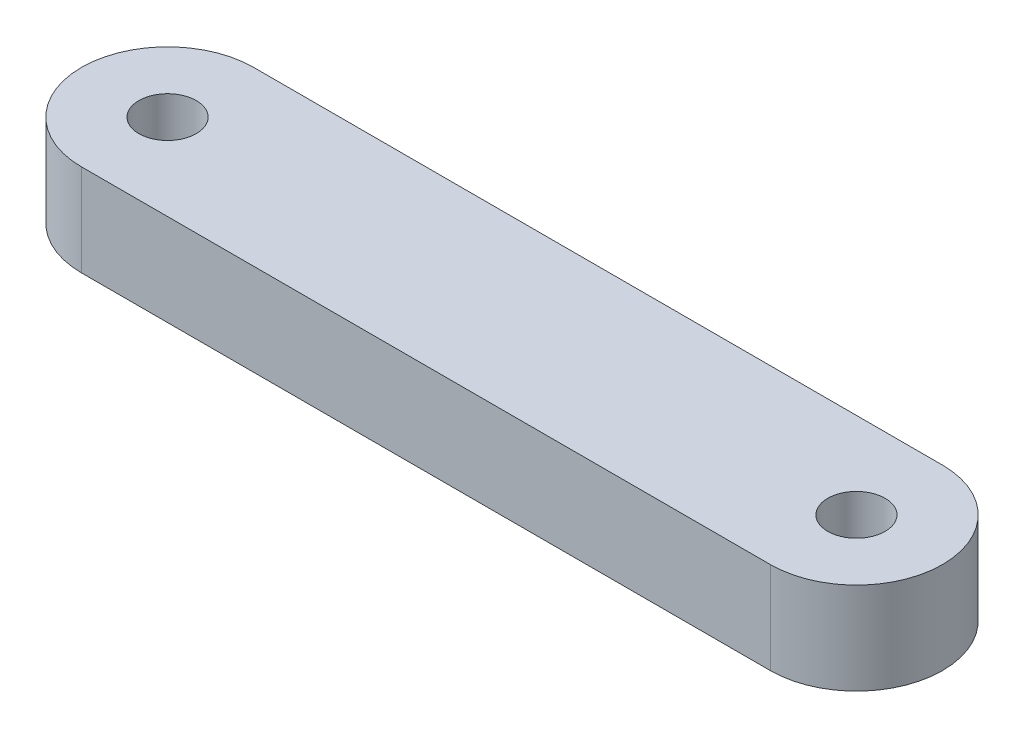
ISO-10303-21;
HEADER;
FILE_DESCRIPTION(('STEP AP214'),'2;1');
FILE_NAME('part.step','',(''),(''),'','','');
FILE_SCHEMA(('AUTOMOTIVE_DESIGN { 1 0 10303 214 1 1 1 1 }'));
ENDSEC;
DATA;
#1=APPLICATION_CONTEXT('core data for automotive mechanical design processes');
#2=APPLICATION_PROTOCOL_DEFINITION('international standard','automotive_design',2000,#1);
#3=PRODUCT_CONTEXT('',#1,'mechanical');
#4=PRODUCT('Part','Part','',(#3));
#5=PRODUCT_RELATED_PRODUCT_CATEGORY('part','',(#4));
#6=PRODUCT_DEFINITION_FORMATION('','',#4);
#7=PRODUCT_DEFINITION_CONTEXT('part definition',#1,'design');
#8=PRODUCT_DEFINITION('design','',#6,#7);
#9=PRODUCT_DEFINITION_SHAPE('','',#8);
#10=(LENGTH_UNIT() NAMED_UNIT(*) SI_UNIT(.MILLI.,.METRE.));
#11=(NAMED_UNIT(*) PLANE_ANGLE_UNIT() SI_UNIT($,.RADIAN.));
#12=(NAMED_UNIT(*) SI_UNIT($,.STERADIAN.) SOLID_ANGLE_UNIT());
#13=UNCERTAINTY_MEASURE_WITH_UNIT(LENGTH_MEASURE(1.E-05),#10,'distance_accuracy_value','');
#14=(GEOMETRIC_REPRESENTATION_CONTEXT(3) GLOBAL_UNCERTAINTY_ASSIGNED_CONTEXT((#13)) GLOBAL_UNIT_ASSIGNED_CONTEXT((#10,
#11,#12)) REPRESENTATION_CONTEXT('',''));
#15=CARTESIAN_POINT('',(0.,0.,0.));
#16=DIRECTION('',(0.,0.,1.));
#17=DIRECTION('',(1.,0.,0.));
#18=AXIS2_PLACEMENT_3D('',#15,#16,#17);
#19=CARTESIAN_POINT('',(0.,40.,0.));
#20=DIRECTION('',(0.,1.,0.));
#21=DIRECTION('',(0.,0.,1.));
#22=AXIS2_PLACEMENT_3D('',#19,#20,#21);
#23=PLANE('',#22);
#24=CARTESIAN_POINT('',(0.,40.,0.));
#25=DIRECTION('',(0.,1.,0.));
#26=DIRECTION('',(0.,0.,1.));
#27=AXIS2_PLACEMENT_3D('',#24,#25,#26);
#28=CIRCLE('',#27,12.5);
#29=CARTESIAN_POINT('',(0.,40.,12.5));
#30=VERTEX_POINT('',#29);
#31=EDGE_CURVE('E112',#30,#30,#28,.T.);
#32=ORIENTED_EDGE('',*,*,#31,.F.);
#33=EDGE_LOOP('',(#32));
#34=FACE_BOUND('',#33,.T.);
#35=CARTESIAN_POINT('',(0.,40.,0.));
#36=DIRECTION('',(0.,1.,0.));
#37=DIRECTION('',(0.,0.,1.));
#38=AXIS2_PLACEMENT_3D('',#35,#36,#37);
#39=CIRCLE('',#38,37.5);
#40=CARTESIAN_POINT('',(0.,40.,-37.5));
#41=VERTEX_POINT('',#40);
#42=CARTESIAN_POINT('',(0.,40.,37.5));
#43=VERTEX_POINT('',#42);
#44=EDGE_CURVE('E92',#41,#43,#39,.T.);
#45=ORIENTED_EDGE('',*,*,#44,.T.);
#46=DIRECTION('',(1.,0.,0.));
#47=VECTOR('',#46,1.);
#48=CARTESIAN_POINT('',(0.,40.,37.5));
#49=LINE('',#48,#47);
#50=CARTESIAN_POINT('',(300.,40.,37.5));
#51=VERTEX_POINT('',#50);
#52=EDGE_CURVE('E87',#43,#51,#49,.T.);
#53=ORIENTED_EDGE('',*,*,#52,.T.);
#54=CARTESIAN_POINT('',(300.,40.,0.));
#55=DIRECTION('',(0.,1.,0.));
#56=DIRECTION('',(0.,0.,1.));
#57=AXIS2_PLACEMENT_3D('',#54,#55,#56);
#58=CIRCLE('',#57,37.5);
#59=CARTESIAN_POINT('',(300.,40.,-37.5));
#60=VERTEX_POINT('',#59);
#61=EDGE_CURVE('E90',#51,#60,#58,.T.);
#62=ORIENTED_EDGE('',*,*,#61,.T.);
#63=DIRECTION('',(-1.,0.,0.));
#64=VECTOR('',#63,1.);
#65=CARTESIAN_POINT('',(0.,40.,-37.5));
#66=LINE('',#65,#64);
#67=EDGE_CURVE('E57',#60,#41,#66,.T.);
#68=ORIENTED_EDGE('',*,*,#67,.T.);
#69=EDGE_LOOP('',(#45,#53,#62,#68));
#70=FACE_BOUND('',#69,.T.);
#71=CARTESIAN_POINT('',(300.,40.,0.));
#72=DIRECTION('',(0.,1.,0.));
#73=DIRECTION('',(0.,0.,1.));
#74=AXIS2_PLACEMENT_3D('',#71,#72,#73);
#75=CIRCLE('',#74,12.5);
#76=CARTESIAN_POINT('',(300.,40.,12.5));
#77=VERTEX_POINT('',#76);
#78=EDGE_CURVE('E134',#77,#77,#75,.T.);
#79=ORIENTED_EDGE('',*,*,#78,.F.);
#80=EDGE_LOOP('',(#79));
#81=FACE_BOUND('',#80,.T.);
#82=ADVANCED_FACE('F39',(#34,#70,#81),#23,.T.);
#83=CARTESIAN_POINT('',(0.,0.,0.));
#84=DIRECTION('',(0.,1.,0.));
#85=DIRECTION('',(0.,0.,1.));
#86=AXIS2_PLACEMENT_3D('',#83,#84,#85);
#87=PLANE('',#86);
#88=CARTESIAN_POINT('',(0.,0.,0.));
#89=DIRECTION('',(0.,1.,0.));
#90=DIRECTION('',(0.,0.,1.));
#91=AXIS2_PLACEMENT_3D('',#88,#89,#90);
#92=CIRCLE('',#91,37.5);
#93=CARTESIAN_POINT('',(0.,0.,-37.5));
#94=VERTEX_POINT('',#93);
#95=CARTESIAN_POINT('',(0.,0.,37.5));
#96=VERTEX_POINT('',#95);
#97=EDGE_CURVE('E108',#94,#96,#92,.T.);
#98=ORIENTED_EDGE('',*,*,#97,.F.);
#99=DIRECTION('',(-1.,0.,0.));
#100=VECTOR('',#99,1.);
#101=CARTESIAN_POINT('',(0.,0.,-37.5));
#102=LINE('',#101,#100);
#103=CARTESIAN_POINT('',(300.,0.,-37.5));
#104=VERTEX_POINT('',#103);
#105=EDGE_CURVE('E80',#104,#94,#102,.T.);
#106=ORIENTED_EDGE('',*,*,#105,.F.);
#107=CARTESIAN_POINT('',(300.,0.,0.));
#108=DIRECTION('',(0.,1.,0.));
#109=DIRECTION('',(0.,0.,1.));
#110=AXIS2_PLACEMENT_3D('',#107,#108,#109);
#111=CIRCLE('',#110,37.5);
#112=CARTESIAN_POINT('',(300.,0.,37.5));
#113=VERTEX_POINT('',#112);
#114=EDGE_CURVE('E74',#113,#104,#111,.T.);
#115=ORIENTED_EDGE('',*,*,#114,.F.);
#116=DIRECTION('',(1.,0.,0.));
#117=VECTOR('',#116,1.);
#118=CARTESIAN_POINT('',(0.,0.,37.5));
#119=LINE('',#118,#117);
#120=EDGE_CURVE('E97',#96,#113,#119,.T.);
#121=ORIENTED_EDGE('',*,*,#120,.F.);
#122=EDGE_LOOP('',(#98,#106,#115,#121));
#123=FACE_BOUND('',#122,.T.);
#124=CARTESIAN_POINT('',(0.,0.,0.));
#125=DIRECTION('',(0.,1.,0.));
#126=DIRECTION('',(0.,0.,1.));
#127=AXIS2_PLACEMENT_3D('',#124,#125,#126);
#128=CIRCLE('',#127,12.5);
#129=CARTESIAN_POINT('',(0.,0.,12.5));
#130=VERTEX_POINT('',#129);
#131=EDGE_CURVE('E130',#130,#130,#128,.T.);
#132=ORIENTED_EDGE('',*,*,#131,.T.);
#133=EDGE_LOOP('',(#132));
#134=FACE_BOUND('',#133,.T.);
#135=CARTESIAN_POINT('',(300.,0.,0.));
#136=DIRECTION('',(0.,1.,0.));
#137=DIRECTION('',(0.,0.,1.));
#138=AXIS2_PLACEMENT_3D('',#135,#136,#137);
#139=CIRCLE('',#138,12.5);
#140=CARTESIAN_POINT('',(300.,0.,12.5));
#141=VERTEX_POINT('',#140);
#142=EDGE_CURVE('E138',#141,#141,#139,.T.);
#143=ORIENTED_EDGE('',*,*,#142,.T.);
#144=EDGE_LOOP('',(#143));
#145=FACE_BOUND('',#144,.T.);
#146=ADVANCED_FACE('F125',(#123,#134,#145),#87,.F.);
#147=CARTESIAN_POINT('',(0.,40.,0.));
#148=DIRECTION('',(0.,-1.,0.));
#149=DIRECTION('',(0.,0.,-1.));
#150=AXIS2_PLACEMENT_3D('',#147,#148,#149);
#151=CYLINDRICAL_SURFACE('',#150,37.5);
#152=ORIENTED_EDGE('',*,*,#97,.T.);
#153=DIRECTION('',(0.,-1.,0.));
#154=VECTOR('',#153,1.);
#155=CARTESIAN_POINT('',(0.,40.,37.5));
#156=LINE('',#155,#154);
#157=EDGE_CURVE('E11',#43,#96,#156,.T.);
#158=ORIENTED_EDGE('',*,*,#157,.F.);
#159=ORIENTED_EDGE('',*,*,#44,.F.);
#160=DIRECTION('',(0.,-1.,0.));
#161=VECTOR('',#160,1.);
#162=CARTESIAN_POINT('',(0.,40.,-37.5));
#163=LINE('',#162,#161);
#164=EDGE_CURVE('E104',#41,#94,#163,.T.);
#165=ORIENTED_EDGE('',*,*,#164,.T.);
#166=EDGE_LOOP('',(#152,#158,#159,#165));
#167=FACE_BOUND('',#166,.T.);
#168=ADVANCED_FACE('F41',(#167),#151,.T.);
#169=CARTESIAN_POINT('',(0.,40.,37.5));
#170=DIRECTION('',(0.,0.,-1.));
#171=DIRECTION('',(-1.,0.,0.));
#172=AXIS2_PLACEMENT_3D('',#169,#170,#171);
#173=PLANE('',#172);
#174=ORIENTED_EDGE('',*,*,#120,.T.);
#175=DIRECTION('',(0.,-1.,0.));
#176=VECTOR('',#175,1.);
#177=CARTESIAN_POINT('',(300.,40.,37.5));
#178=LINE('',#177,#176);
#179=EDGE_CURVE('E49',#51,#113,#178,.T.);
#180=ORIENTED_EDGE('',*,*,#179,.F.);
#181=ORIENTED_EDGE('',*,*,#52,.F.);
#182=ORIENTED_EDGE('',*,*,#157,.T.);
#183=EDGE_LOOP('',(#174,#180,#181,#182));
#184=FACE_BOUND('',#183,.T.);
#185=ADVANCED_FACE('F96',(#184),#173,.F.);
#186=CARTESIAN_POINT('',(300.,40.,0.));
#187=DIRECTION('',(0.,-1.,0.));
#188=DIRECTION('',(0.,0.,-1.));
#189=AXIS2_PLACEMENT_3D('',#186,#187,#188);
#190=CYLINDRICAL_SURFACE('',#189,37.5);
#191=ORIENTED_EDGE('',*,*,#114,.T.);
#192=DIRECTION('',(0.,-1.,0.));
#193=VECTOR('',#192,1.);
#194=CARTESIAN_POINT('',(300.,40.,-37.5));
#195=LINE('',#194,#193);
#196=EDGE_CURVE('E99',#60,#104,#195,.T.);
#197=ORIENTED_EDGE('',*,*,#196,.F.);
#198=ORIENTED_EDGE('',*,*,#61,.F.);
#199=ORIENTED_EDGE('',*,*,#179,.T.);
#200=EDGE_LOOP('',(#191,#197,#198,#199));
#201=FACE_BOUND('',#200,.T.);
#202=ADVANCED_FACE('F100',(#201),#190,.T.);
#203=CARTESIAN_POINT('',(0.,40.,-37.5));
#204=DIRECTION('',(0.,0.,1.));
#205=DIRECTION('',(1.,0.,0.));
#206=AXIS2_PLACEMENT_3D('',#203,#204,#205);
#207=PLANE('',#206);
#208=ORIENTED_EDGE('',*,*,#105,.T.);
#209=ORIENTED_EDGE('',*,*,#164,.F.);
#210=ORIENTED_EDGE('',*,*,#67,.F.);
#211=ORIENTED_EDGE('',*,*,#196,.T.);
#212=EDGE_LOOP('',(#208,#209,#210,#211));
#213=FACE_BOUND('',#212,.T.);
#214=ADVANCED_FACE('F122',(#213),#207,.F.);
#215=CARTESIAN_POINT('',(0.,40.,0.));
#216=DIRECTION('',(0.,-1.,0.));
#217=DIRECTION('',(0.,0.,-1.));
#218=AXIS2_PLACEMENT_3D('',#215,#216,#217);
#219=CYLINDRICAL_SURFACE('',#218,12.5);
#220=ORIENTED_EDGE('',*,*,#31,.T.);
#221=EDGE_LOOP('',(#220));
#222=FACE_BOUND('',#221,.T.);
#223=ORIENTED_EDGE('',*,*,#131,.F.);
#224=EDGE_LOOP('',(#223));
#225=FACE_BOUND('',#224,.T.);
#226=ADVANCED_FACE('F157',(#222,#225),#219,.F.);
#227=CARTESIAN_POINT('',(300.,40.,0.));
#228=DIRECTION('',(0.,-1.,0.));
#229=DIRECTION('',(0.,0.,-1.));
#230=AXIS2_PLACEMENT_3D('',#227,#228,#229);
#231=CYLINDRICAL_SURFACE('',#230,12.5);
#232=ORIENTED_EDGE('',*,*,#78,.T.);
#233=EDGE_LOOP('',(#232));
#234=FACE_BOUND('',#233,.T.);
#235=ORIENTED_EDGE('',*,*,#142,.F.);
#236=EDGE_LOOP('',(#235));
#237=FACE_BOUND('',#236,.T.);
#238=ADVANCED_FACE('F146',(#234,#237),#231,.F.);
#239=CLOSED_SHELL('',(#82,#146,#168,#185,#202,#214,#226,#238));
#240=MANIFOLD_SOLID_BREP('B2',#239);
#241=ADVANCED_BREP_SHAPE_REPRESENTATION('',(#18,#240),#14);
#242=SHAPE_DEFINITION_REPRESENTATION(#9,#241);
ENDSEC;
END-ISO-10303-21;
